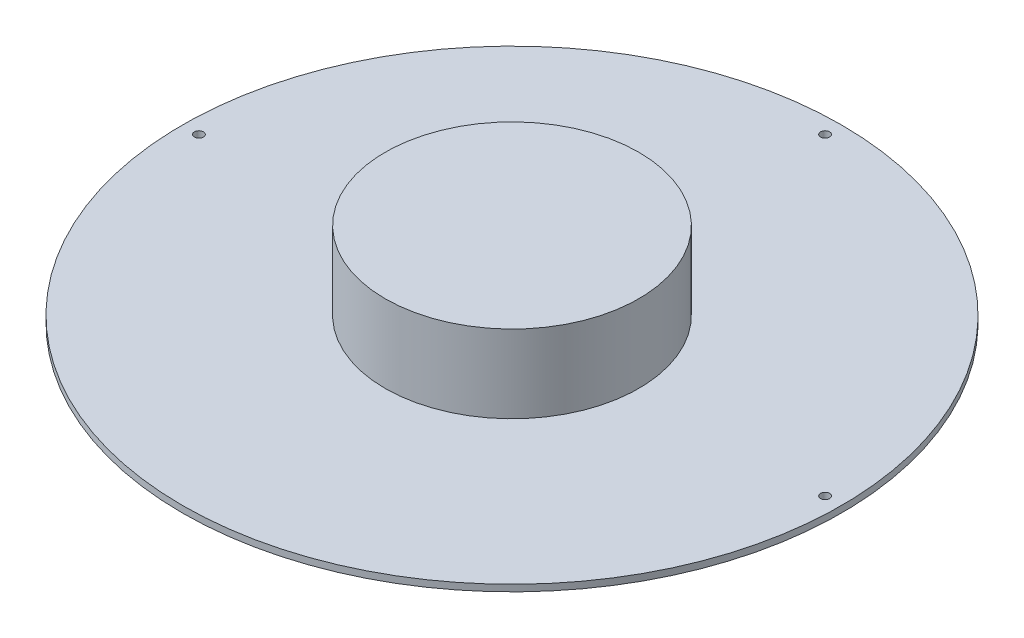
ISO-10303-21;
HEADER;
FILE_DESCRIPTION(('STEP AP214'),'2;1');
FILE_NAME('part.step','',(''),(''),'','','');
FILE_SCHEMA(('AUTOMOTIVE_DESIGN { 1 0 10303 214 1 1 1 1 }'));
ENDSEC;
DATA;
#1=APPLICATION_CONTEXT('core data for automotive mechanical design processes');
#2=APPLICATION_PROTOCOL_DEFINITION('international standard','automotive_design',2000,#1);
#3=PRODUCT_CONTEXT('',#1,'mechanical');
#4=PRODUCT('Part','Part','',(#3));
#5=PRODUCT_RELATED_PRODUCT_CATEGORY('part','',(#4));
#6=PRODUCT_DEFINITION_FORMATION('','',#4);
#7=PRODUCT_DEFINITION_CONTEXT('part definition',#1,'design');
#8=PRODUCT_DEFINITION('design','',#6,#7);
#9=PRODUCT_DEFINITION_SHAPE('','',#8);
#10=(LENGTH_UNIT() NAMED_UNIT(*) SI_UNIT(.MILLI.,.METRE.));
#11=(NAMED_UNIT(*) PLANE_ANGLE_UNIT() SI_UNIT($,.RADIAN.));
#12=(NAMED_UNIT(*) SI_UNIT($,.STERADIAN.) SOLID_ANGLE_UNIT());
#13=UNCERTAINTY_MEASURE_WITH_UNIT(LENGTH_MEASURE(1.E-05),#10,'distance_accuracy_value','');
#14=(GEOMETRIC_REPRESENTATION_CONTEXT(3) GLOBAL_UNCERTAINTY_ASSIGNED_CONTEXT((#13)) GLOBAL_UNIT_ASSIGNED_CONTEXT((#10,
#11,#12)) REPRESENTATION_CONTEXT('',''));
#15=CARTESIAN_POINT('',(0.,0.,0.));
#16=DIRECTION('',(0.,0.,1.));
#17=DIRECTION('',(1.,0.,0.));
#18=AXIS2_PLACEMENT_3D('',#15,#16,#17);
#19=CARTESIAN_POINT('',(0.,1.6,0.));
#20=DIRECTION('',(0.,-1.,0.));
#21=DIRECTION('',(0.,0.,-1.));
#22=AXIS2_PLACEMENT_3D('',#19,#20,#21);
#23=CYLINDRICAL_SURFACE('',#22,80.);
#24=CARTESIAN_POINT('',(0.,1.6,0.));
#25=DIRECTION('',(0.,1.,0.));
#26=DIRECTION('',(0.,0.,1.));
#27=AXIS2_PLACEMENT_3D('',#24,#25,#26);
#28=CIRCLE('',#27,80.);
#29=CARTESIAN_POINT('',(0.,1.6,80.));
#30=VERTEX_POINT('',#29);
#31=EDGE_CURVE('E52',#30,#30,#28,.T.);
#32=ORIENTED_EDGE('',*,*,#31,.F.);
#33=EDGE_LOOP('',(#32));
#34=FACE_BOUND('',#33,.T.);
#35=CARTESIAN_POINT('',(0.,0.,0.));
#36=DIRECTION('',(0.,1.,0.));
#37=DIRECTION('',(0.,0.,1.));
#38=AXIS2_PLACEMENT_3D('',#35,#36,#37);
#39=CIRCLE('',#38,80.);
#40=CARTESIAN_POINT('',(0.,0.,80.));
#41=VERTEX_POINT('',#40);
#42=EDGE_CURVE('E100',#41,#41,#39,.T.);
#43=ORIENTED_EDGE('',*,*,#42,.T.);
#44=EDGE_LOOP('',(#43));
#45=FACE_BOUND('',#44,.T.);
#46=ADVANCED_FACE('F39',(#34,#45),#23,.T.);
#47=CARTESIAN_POINT('',(0.,1.6,0.));
#48=DIRECTION('',(0.,1.,0.));
#49=DIRECTION('',(0.,0.,1.));
#50=AXIS2_PLACEMENT_3D('',#47,#48,#49);
#51=PLANE('',#50);
#52=CARTESIAN_POINT('',(0.,1.6,0.));
#53=DIRECTION('',(0.,1.,0.));
#54=DIRECTION('',(0.,0.,1.));
#55=AXIS2_PLACEMENT_3D('',#52,#53,#54);
#56=CIRCLE('',#55,30.8);
#57=CARTESIAN_POINT('',(0.,1.6,30.8));
#58=VERTEX_POINT('',#57);
#59=EDGE_CURVE('E60',#58,#58,#56,.T.);
#60=ORIENTED_EDGE('',*,*,#59,.F.);
#61=EDGE_LOOP('',(#60));
#62=FACE_BOUND('',#61,.T.);
#63=CARTESIAN_POINT('',(0.,1.6,-76.));
#64=DIRECTION('',(0.,1.,0.));
#65=DIRECTION('',(0.,0.,1.));
#66=AXIS2_PLACEMENT_3D('',#63,#64,#65);
#67=CIRCLE('',#66,1.09999999999999);
#68=CARTESIAN_POINT('',(0.,1.6,-74.9));
#69=VERTEX_POINT('',#68);
#70=EDGE_CURVE('E72',#69,#69,#67,.T.);
#71=ORIENTED_EDGE('',*,*,#70,.F.);
#72=EDGE_LOOP('',(#71));
#73=FACE_BOUND('',#72,.T.);
#74=CARTESIAN_POINT('',(76.,1.6,0.));
#75=DIRECTION('',(0.,1.,0.));
#76=DIRECTION('',(0.,0.,1.));
#77=AXIS2_PLACEMENT_3D('',#74,#75,#76);
#78=CIRCLE('',#77,1.09999999999999);
#79=CARTESIAN_POINT('',(76.,1.6,1.09999999999999));
#80=VERTEX_POINT('',#79);
#81=EDGE_CURVE('E80',#80,#80,#78,.T.);
#82=ORIENTED_EDGE('',*,*,#81,.F.);
#83=EDGE_LOOP('',(#82));
#84=FACE_BOUND('',#83,.T.);
#85=CARTESIAN_POINT('',(-76.,1.6,0.));
#86=DIRECTION('',(0.,1.,0.));
#87=DIRECTION('',(0.,0.,1.));
#88=AXIS2_PLACEMENT_3D('',#85,#86,#87);
#89=CIRCLE('',#88,1.09999999999999);
#90=CARTESIAN_POINT('',(-76.,1.6,1.09999999999999));
#91=VERTEX_POINT('',#90);
#92=EDGE_CURVE('E88',#91,#91,#89,.T.);
#93=ORIENTED_EDGE('',*,*,#92,.F.);
#94=EDGE_LOOP('',(#93));
#95=FACE_BOUND('',#94,.T.);
#96=ORIENTED_EDGE('',*,*,#31,.T.);
#97=EDGE_LOOP('',(#96));
#98=FACE_BOUND('',#97,.T.);
#99=ADVANCED_FACE('F111',(#62,#73,#84,#95,#98),#51,.T.);
#100=CARTESIAN_POINT('',(0.,0.,0.));
#101=DIRECTION('',(0.,1.,0.));
#102=DIRECTION('',(0.,0.,1.));
#103=AXIS2_PLACEMENT_3D('',#100,#101,#102);
#104=PLANE('',#103);
#105=CARTESIAN_POINT('',(0.,0.,-76.));
#106=DIRECTION('',(0.,1.,0.));
#107=DIRECTION('',(0.,0.,1.));
#108=AXIS2_PLACEMENT_3D('',#105,#106,#107);
#109=CIRCLE('',#108,1.09999999999999);
#110=CARTESIAN_POINT('',(0.,0.,-74.9));
#111=VERTEX_POINT('',#110);
#112=EDGE_CURVE('E76',#111,#111,#109,.T.);
#113=ORIENTED_EDGE('',*,*,#112,.T.);
#114=EDGE_LOOP('',(#113));
#115=FACE_BOUND('',#114,.T.);
#116=CARTESIAN_POINT('',(76.,0.,0.));
#117=DIRECTION('',(0.,1.,0.));
#118=DIRECTION('',(0.,0.,1.));
#119=AXIS2_PLACEMENT_3D('',#116,#117,#118);
#120=CIRCLE('',#119,1.09999999999999);
#121=CARTESIAN_POINT('',(76.,0.,1.09999999999999));
#122=VERTEX_POINT('',#121);
#123=EDGE_CURVE('E84',#122,#122,#120,.T.);
#124=ORIENTED_EDGE('',*,*,#123,.T.);
#125=EDGE_LOOP('',(#124));
#126=FACE_BOUND('',#125,.T.);
#127=CARTESIAN_POINT('',(-76.,0.,0.));
#128=DIRECTION('',(0.,1.,0.));
#129=DIRECTION('',(0.,0.,1.));
#130=AXIS2_PLACEMENT_3D('',#127,#128,#129);
#131=CIRCLE('',#130,1.09999999999999);
#132=CARTESIAN_POINT('',(-76.,0.,1.09999999999999));
#133=VERTEX_POINT('',#132);
#134=EDGE_CURVE('E92',#133,#133,#131,.T.);
#135=ORIENTED_EDGE('',*,*,#134,.T.);
#136=EDGE_LOOP('',(#135));
#137=FACE_BOUND('',#136,.T.);
#138=CARTESIAN_POINT('',(0.,0.,0.));
#139=DIRECTION('',(0.,1.,0.));
#140=DIRECTION('',(0.,0.,1.));
#141=AXIS2_PLACEMENT_3D('',#138,#139,#140);
#142=CIRCLE('',#141,2.3);
#143=CARTESIAN_POINT('',(0.,0.,2.3));
#144=VERTEX_POINT('',#143);
#145=EDGE_CURVE('E96',#144,#144,#142,.T.);
#146=ORIENTED_EDGE('',*,*,#145,.T.);
#147=EDGE_LOOP('',(#146));
#148=FACE_BOUND('',#147,.T.);
#149=ORIENTED_EDGE('',*,*,#42,.F.);
#150=EDGE_LOOP('',(#149));
#151=FACE_BOUND('',#150,.T.);
#152=ADVANCED_FACE('F108',(#115,#126,#137,#148,#151),#104,.F.);
#153=CARTESIAN_POINT('',(0.,0.,0.));
#154=DIRECTION('',(0.,1.,0.));
#155=DIRECTION('',(0.,0.,1.));
#156=AXIS2_PLACEMENT_3D('',#153,#154,#155);
#157=CYLINDRICAL_SURFACE('',#156,2.3);
#158=ORIENTED_EDGE('',*,*,#145,.F.);
#159=EDGE_LOOP('',(#158));
#160=FACE_BOUND('',#159,.T.);
#161=CARTESIAN_POINT('',(0.,1.6,0.));
#162=DIRECTION('',(0.,1.,0.));
#163=DIRECTION('',(0.,0.,1.));
#164=AXIS2_PLACEMENT_3D('',#161,#162,#163);
#165=CIRCLE('',#164,2.3);
#166=CARTESIAN_POINT('',(0.,1.6,2.3));
#167=VERTEX_POINT('',#166);
#168=EDGE_CURVE('E65',#167,#167,#165,.F.);
#169=ORIENTED_EDGE('',*,*,#168,.F.);
#170=EDGE_LOOP('',(#169));
#171=FACE_BOUND('',#170,.T.);
#172=ADVANCED_FACE('F110',(#160,#171),#157,.F.);
#173=CARTESIAN_POINT('',(-76.,1.6,0.));
#174=DIRECTION('',(0.,1.,0.));
#175=DIRECTION('',(0.,0.,1.));
#176=AXIS2_PLACEMENT_3D('',#173,#174,#175);
#177=CYLINDRICAL_SURFACE('',#176,1.09999999999999);
#178=ORIENTED_EDGE('',*,*,#92,.T.);
#179=EDGE_LOOP('',(#178));
#180=FACE_BOUND('',#179,.T.);
#181=ORIENTED_EDGE('',*,*,#134,.F.);
#182=EDGE_LOOP('',(#181));
#183=FACE_BOUND('',#182,.T.);
#184=ADVANCED_FACE('F117',(#180,#183),#177,.F.);
#185=CARTESIAN_POINT('',(76.,1.6,0.));
#186=DIRECTION('',(0.,1.,0.));
#187=DIRECTION('',(0.,0.,1.));
#188=AXIS2_PLACEMENT_3D('',#185,#186,#187);
#189=CYLINDRICAL_SURFACE('',#188,1.09999999999999);
#190=ORIENTED_EDGE('',*,*,#81,.T.);
#191=EDGE_LOOP('',(#190));
#192=FACE_BOUND('',#191,.T.);
#193=ORIENTED_EDGE('',*,*,#123,.F.);
#194=EDGE_LOOP('',(#193));
#195=FACE_BOUND('',#194,.T.);
#196=ADVANCED_FACE('F218',(#192,#195),#189,.F.);
#197=CARTESIAN_POINT('',(0.,1.6,-76.));
#198=DIRECTION('',(0.,1.,0.));
#199=DIRECTION('',(0.,0.,1.));
#200=AXIS2_PLACEMENT_3D('',#197,#198,#199);
#201=CYLINDRICAL_SURFACE('',#200,1.09999999999999);
#202=ORIENTED_EDGE('',*,*,#70,.T.);
#203=EDGE_LOOP('',(#202));
#204=FACE_BOUND('',#203,.T.);
#205=ORIENTED_EDGE('',*,*,#112,.F.);
#206=EDGE_LOOP('',(#205));
#207=FACE_BOUND('',#206,.T.);
#208=ADVANCED_FACE('F141',(#204,#207),#201,.F.);
#209=CARTESIAN_POINT('',(0.,1.6,0.));
#210=DIRECTION('',(0.,1.,0.));
#211=DIRECTION('',(0.,0.,1.));
#212=AXIS2_PLACEMENT_3D('',#209,#210,#211);
#213=PLANE('',#212);
#214=CARTESIAN_POINT('',(0.,1.6,0.));
#215=DIRECTION('',(0.,1.,0.));
#216=DIRECTION('',(0.,0.,1.));
#217=AXIS2_PLACEMENT_3D('',#214,#215,#216);
#218=CIRCLE('',#217,1.5);
#219=CARTESIAN_POINT('',(0.,1.6,1.5));
#220=VERTEX_POINT('',#219);
#221=EDGE_CURVE('E42',#220,#220,#218,.F.);
#222=ORIENTED_EDGE('',*,*,#221,.F.);
#223=EDGE_LOOP('',(#222));
#224=FACE_BOUND('',#223,.T.);
#225=ORIENTED_EDGE('',*,*,#168,.T.);
#226=EDGE_LOOP('',(#225));
#227=FACE_BOUND('',#226,.T.);
#228=ADVANCED_FACE('F152',(#224,#227),#213,.F.);
#229=CARTESIAN_POINT('',(0.,20.46,0.));
#230=DIRECTION('',(0.,-1.,0.));
#231=DIRECTION('',(0.,0.,-1.));
#232=AXIS2_PLACEMENT_3D('',#229,#230,#231);
#233=CYLINDRICAL_SURFACE('',#232,30.8);
#234=CARTESIAN_POINT('',(0.,20.46,0.));
#235=DIRECTION('',(0.,1.,0.));
#236=DIRECTION('',(0.,0.,1.));
#237=AXIS2_PLACEMENT_3D('',#234,#235,#236);
#238=CIRCLE('',#237,30.8);
#239=CARTESIAN_POINT('',(0.,20.46,30.8));
#240=VERTEX_POINT('',#239);
#241=EDGE_CURVE('E61',#240,#240,#238,.T.);
#242=ORIENTED_EDGE('',*,*,#241,.F.);
#243=EDGE_LOOP('',(#242));
#244=FACE_BOUND('',#243,.T.);
#245=ORIENTED_EDGE('',*,*,#59,.T.);
#246=EDGE_LOOP('',(#245));
#247=FACE_BOUND('',#246,.T.);
#248=ADVANCED_FACE('F146',(#244,#247),#233,.T.);
#249=CARTESIAN_POINT('',(0.,20.46,0.));
#250=DIRECTION('',(0.,1.,0.));
#251=DIRECTION('',(0.,0.,1.));
#252=AXIS2_PLACEMENT_3D('',#249,#250,#251);
#253=PLANE('',#252);
#254=ORIENTED_EDGE('',*,*,#241,.T.);
#255=EDGE_LOOP('',(#254));
#256=FACE_BOUND('',#255,.T.);
#257=ADVANCED_FACE('F151',(#256),#253,.T.);
#258=CARTESIAN_POINT('',(0.,-2.4,0.));
#259=DIRECTION('',(0.,1.,0.));
#260=DIRECTION('',(0.,0.,1.));
#261=AXIS2_PLACEMENT_3D('',#258,#259,#260);
#262=CYLINDRICAL_SURFACE('',#261,1.5);
#263=CARTESIAN_POINT('',(0.,-2.4,0.));
#264=DIRECTION('',(0.,-1.,0.));
#265=DIRECTION('',(0.,0.,-1.));
#266=AXIS2_PLACEMENT_3D('',#263,#264,#265);
#267=CIRCLE('',#266,1.5);
#268=CARTESIAN_POINT('',(0.,-2.4,-1.5));
#269=VERTEX_POINT('',#268);
#270=EDGE_CURVE('E56',#269,#269,#267,.T.);
#271=ORIENTED_EDGE('',*,*,#270,.F.);
#272=EDGE_LOOP('',(#271));
#273=FACE_BOUND('',#272,.T.);
#274=ORIENTED_EDGE('',*,*,#221,.T.);
#275=EDGE_LOOP('',(#274));
#276=FACE_BOUND('',#275,.T.);
#277=ADVANCED_FACE('F164',(#273,#276),#262,.T.);
#278=CARTESIAN_POINT('',(0.,-2.4,0.));
#279=DIRECTION('',(0.,-1.,0.));
#280=DIRECTION('',(0.,0.,-1.));
#281=AXIS2_PLACEMENT_3D('',#278,#279,#280);
#282=PLANE('',#281);
#283=CARTESIAN_POINT('',(0.,-2.4,0.));
#284=DIRECTION('',(0.,-1.,0.));
#285=DIRECTION('',(0.,0.,-1.));
#286=AXIS2_PLACEMENT_3D('',#283,#284,#285);
#287=CIRCLE('',#286,0.7);
#288=CARTESIAN_POINT('',(0.,-2.4,-0.7));
#289=VERTEX_POINT('',#288);
#290=EDGE_CURVE('E10',#289,#289,#287,.T.);
#291=ORIENTED_EDGE('',*,*,#290,.F.);
#292=EDGE_LOOP('',(#291));
#293=FACE_BOUND('',#292,.T.);
#294=ORIENTED_EDGE('',*,*,#270,.T.);
#295=EDGE_LOOP('',(#294));
#296=FACE_BOUND('',#295,.T.);
#297=ADVANCED_FACE('F181',(#293,#296),#282,.T.);
#298=CARTESIAN_POINT('',(0.,-6.2,0.));
#299=DIRECTION('',(0.,1.,0.));
#300=DIRECTION('',(0.,0.,1.));
#301=AXIS2_PLACEMENT_3D('',#298,#299,#300);
#302=CYLINDRICAL_SURFACE('',#301,0.7);
#303=CARTESIAN_POINT('',(0.,-6.2,0.));
#304=DIRECTION('',(0.,-1.,0.));
#305=DIRECTION('',(0.,0.,-1.));
#306=AXIS2_PLACEMENT_3D('',#303,#304,#305);
#307=CIRCLE('',#306,0.7);
#308=CARTESIAN_POINT('',(0.,-6.2,-0.7));
#309=VERTEX_POINT('',#308);
#310=EDGE_CURVE('E55',#309,#309,#307,.T.);
#311=ORIENTED_EDGE('',*,*,#310,.F.);
#312=EDGE_LOOP('',(#311));
#313=FACE_BOUND('',#312,.T.);
#314=ORIENTED_EDGE('',*,*,#290,.T.);
#315=EDGE_LOOP('',(#314));
#316=FACE_BOUND('',#315,.T.);
#317=ADVANCED_FACE('F191',(#313,#316),#302,.T.);
#318=CARTESIAN_POINT('',(0.,-6.2,0.));
#319=DIRECTION('',(0.,-1.,0.));
#320=DIRECTION('',(0.,0.,-1.));
#321=AXIS2_PLACEMENT_3D('',#318,#319,#320);
#322=PLANE('',#321);
#323=ORIENTED_EDGE('',*,*,#310,.T.);
#324=EDGE_LOOP('',(#323));
#325=FACE_BOUND('',#324,.T.);
#326=ADVANCED_FACE('F201',(#325),#322,.T.);
#327=CLOSED_SHELL('',(#46,#99,#152,#172,#184,#196,#208,#228,#248,#257,#277,#297,#317,#326));
#328=MANIFOLD_SOLID_BREP('B2',#327);
#329=ADVANCED_BREP_SHAPE_REPRESENTATION('',(#18,#328),#14);
#330=SHAPE_DEFINITION_REPRESENTATION(#9,#329);
ENDSEC;
END-ISO-10303-21;
